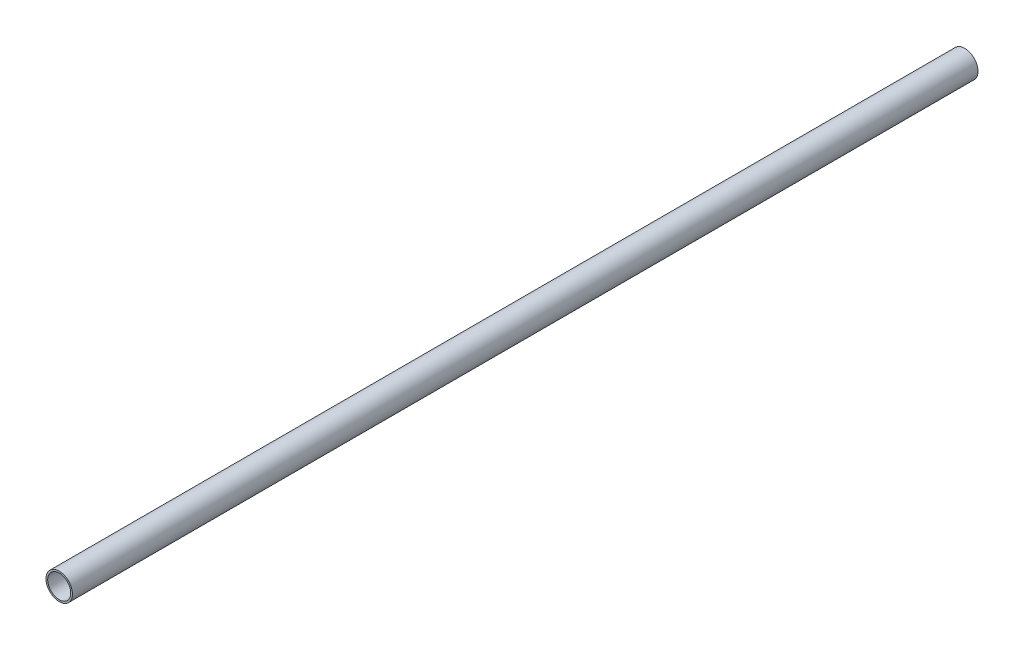
ISO-10303-21;
HEADER;
FILE_DESCRIPTION(('STEP AP214'),'2;1');
FILE_NAME('part.step','',(''),(''),'','','');
FILE_SCHEMA(('AUTOMOTIVE_DESIGN { 1 0 10303 214 1 1 1 1 }'));
ENDSEC;
DATA;
#1=APPLICATION_CONTEXT('core data for automotive mechanical design processes');
#2=APPLICATION_PROTOCOL_DEFINITION('international standard','automotive_design',2000,#1);
#3=PRODUCT_CONTEXT('',#1,'mechanical');
#4=PRODUCT('Part','Part','',(#3));
#5=PRODUCT_RELATED_PRODUCT_CATEGORY('part','',(#4));
#6=PRODUCT_DEFINITION_FORMATION('','',#4);
#7=PRODUCT_DEFINITION_CONTEXT('part definition',#1,'design');
#8=PRODUCT_DEFINITION('design','',#6,#7);
#9=PRODUCT_DEFINITION_SHAPE('','',#8);
#10=(LENGTH_UNIT() NAMED_UNIT(*) SI_UNIT(.MILLI.,.METRE.));
#11=(NAMED_UNIT(*) PLANE_ANGLE_UNIT() SI_UNIT($,.RADIAN.));
#12=(NAMED_UNIT(*) SI_UNIT($,.STERADIAN.) SOLID_ANGLE_UNIT());
#13=UNCERTAINTY_MEASURE_WITH_UNIT(LENGTH_MEASURE(1.E-05),#10,'distance_accuracy_value','');
#14=(GEOMETRIC_REPRESENTATION_CONTEXT(3) GLOBAL_UNCERTAINTY_ASSIGNED_CONTEXT((#13)) GLOBAL_UNIT_ASSIGNED_CONTEXT((#10,
#11,#12)) REPRESENTATION_CONTEXT('',''));
#15=CARTESIAN_POINT('',(0.,0.,0.));
#16=DIRECTION('',(0.,0.,1.));
#17=DIRECTION('',(1.,0.,0.));
#18=AXIS2_PLACEMENT_3D('',#15,#16,#17);
#19=CARTESIAN_POINT('',(157.,40.45,265.));
#20=DIRECTION('',(0.,0.,-1.));
#21=DIRECTION('',(-1.,0.,0.));
#22=AXIS2_PLACEMENT_3D('',#19,#20,#21);
#23=CYLINDRICAL_SURFACE('',#22,7.75);
#24=CARTESIAN_POINT('',(157.,40.45,265.));
#25=DIRECTION('',(0.,0.,1.));
#26=DIRECTION('',(1.,0.,0.));
#27=AXIS2_PLACEMENT_3D('',#24,#25,#26);
#28=CIRCLE('',#27,7.75);
#29=CARTESIAN_POINT('',(164.75,40.45,265.));
#30=VERTEX_POINT('',#29);
#31=EDGE_CURVE('E10',#30,#30,#28,.T.);
#32=ORIENTED_EDGE('',*,*,#31,.F.);
#33=EDGE_LOOP('',(#32));
#34=FACE_BOUND('',#33,.T.);
#35=CARTESIAN_POINT('',(157.,40.45,-265.));
#36=DIRECTION('',(0.,0.,1.));
#37=DIRECTION('',(1.,0.,0.));
#38=AXIS2_PLACEMENT_3D('',#35,#36,#37);
#39=CIRCLE('',#38,7.75);
#40=CARTESIAN_POINT('',(164.75,40.45,-265.));
#41=VERTEX_POINT('',#40);
#42=EDGE_CURVE('E38',#41,#41,#39,.T.);
#43=ORIENTED_EDGE('',*,*,#42,.T.);
#44=EDGE_LOOP('',(#43));
#45=FACE_BOUND('',#44,.T.);
#46=ADVANCED_FACE('F31',(#34,#45),#23,.T.);
#47=CARTESIAN_POINT('',(157.,40.45,265.));
#48=DIRECTION('',(0.,0.,1.));
#49=DIRECTION('',(1.,0.,0.));
#50=AXIS2_PLACEMENT_3D('',#47,#48,#49);
#51=PLANE('',#50);
#52=CARTESIAN_POINT('',(157.,40.45,265.));
#53=DIRECTION('',(0.,0.,1.));
#54=DIRECTION('',(1.,0.,0.));
#55=AXIS2_PLACEMENT_3D('',#52,#53,#54);
#56=CIRCLE('',#55,6.75000000000001);
#57=CARTESIAN_POINT('',(163.75,40.45,265.));
#58=VERTEX_POINT('',#57);
#59=EDGE_CURVE('E43',#58,#58,#56,.T.);
#60=ORIENTED_EDGE('',*,*,#59,.F.);
#61=EDGE_LOOP('',(#60));
#62=FACE_BOUND('',#61,.T.);
#63=ORIENTED_EDGE('',*,*,#31,.T.);
#64=EDGE_LOOP('',(#63));
#65=FACE_BOUND('',#64,.T.);
#66=ADVANCED_FACE('F60',(#62,#65),#51,.T.);
#67=CARTESIAN_POINT('',(157.,40.45,-265.));
#68=DIRECTION('',(0.,0.,1.));
#69=DIRECTION('',(1.,0.,0.));
#70=AXIS2_PLACEMENT_3D('',#67,#68,#69);
#71=PLANE('',#70);
#72=CARTESIAN_POINT('',(157.,40.45,-265.));
#73=DIRECTION('',(0.,0.,1.));
#74=DIRECTION('',(1.,0.,0.));
#75=AXIS2_PLACEMENT_3D('',#72,#73,#74);
#76=CIRCLE('',#75,6.75000000000001);
#77=CARTESIAN_POINT('',(163.75,40.45,-265.));
#78=VERTEX_POINT('',#77);
#79=EDGE_CURVE('E34',#78,#78,#76,.T.);
#80=ORIENTED_EDGE('',*,*,#79,.T.);
#81=EDGE_LOOP('',(#80));
#82=FACE_BOUND('',#81,.T.);
#83=ORIENTED_EDGE('',*,*,#42,.F.);
#84=EDGE_LOOP('',(#83));
#85=FACE_BOUND('',#84,.T.);
#86=ADVANCED_FACE('F51',(#82,#85),#71,.F.);
#87=CARTESIAN_POINT('',(157.,40.45,-284.7));
#88=DIRECTION('',(0.,0.,1.));
#89=DIRECTION('',(1.,0.,0.));
#90=AXIS2_PLACEMENT_3D('',#87,#88,#89);
#91=CYLINDRICAL_SURFACE('',#90,6.75000000000001);
#92=ORIENTED_EDGE('',*,*,#59,.T.);
#93=EDGE_LOOP('',(#92));
#94=FACE_BOUND('',#93,.T.);
#95=ORIENTED_EDGE('',*,*,#79,.F.);
#96=EDGE_LOOP('',(#95));
#97=FACE_BOUND('',#96,.T.);
#98=ADVANCED_FACE('F54',(#94,#97),#91,.F.);
#99=CLOSED_SHELL('',(#46,#66,#86,#98));
#100=MANIFOLD_SOLID_BREP('B2',#99);
#101=ADVANCED_BREP_SHAPE_REPRESENTATION('',(#18,#100),#14);
#102=SHAPE_DEFINITION_REPRESENTATION(#9,#101);
ENDSEC;
END-ISO-10303-21;
